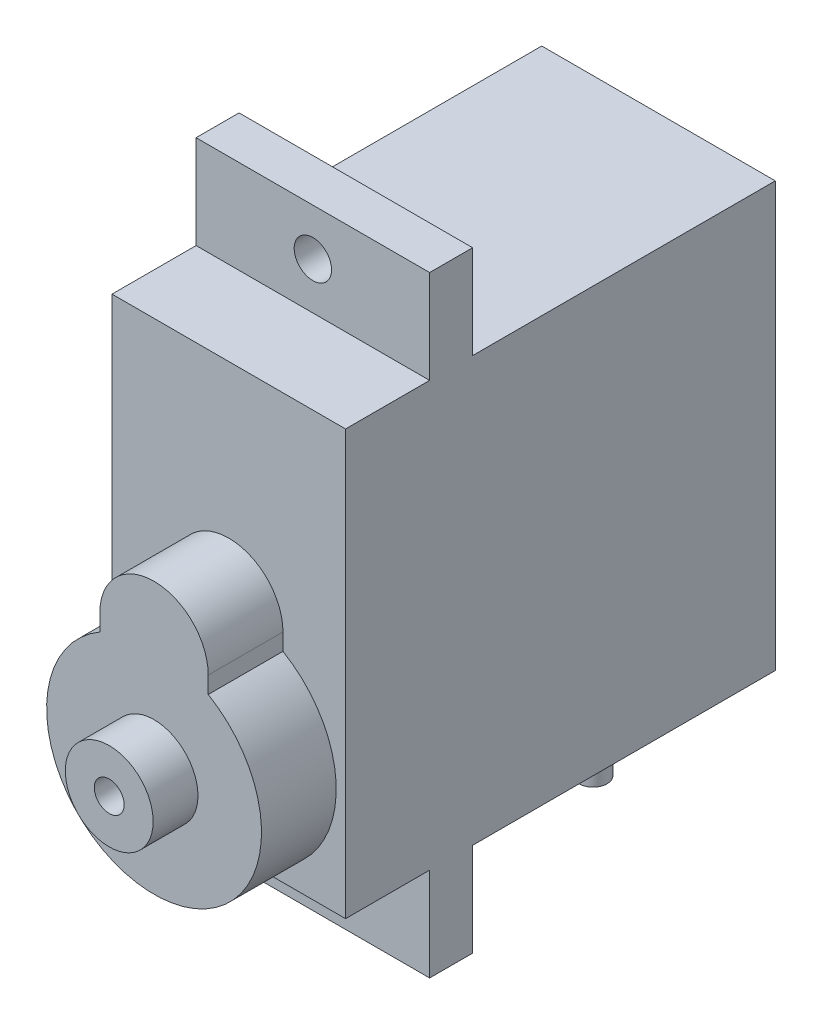
ISO-10303-21;
HEADER;
FILE_DESCRIPTION(('STEP AP214'),'2;1');
FILE_NAME('part.step','',(''),(''),'','','');
FILE_SCHEMA(('AUTOMOTIVE_DESIGN { 1 0 10303 214 1 1 1 1 }'));
ENDSEC;
DATA;
#1=APPLICATION_CONTEXT('core data for automotive mechanical design processes');
#2=APPLICATION_PROTOCOL_DEFINITION('international standard','automotive_design',2000,#1);
#3=PRODUCT_CONTEXT('',#1,'mechanical');
#4=PRODUCT('Part','Part','',(#3));
#5=PRODUCT_RELATED_PRODUCT_CATEGORY('part','',(#4));
#6=PRODUCT_DEFINITION_FORMATION('','',#4);
#7=PRODUCT_DEFINITION_CONTEXT('part definition',#1,'design');
#8=PRODUCT_DEFINITION('design','',#6,#7);
#9=PRODUCT_DEFINITION_SHAPE('','',#8);
#10=(LENGTH_UNIT() NAMED_UNIT(*) SI_UNIT(.MILLI.,.METRE.));
#11=(NAMED_UNIT(*) PLANE_ANGLE_UNIT() SI_UNIT($,.RADIAN.));
#12=(NAMED_UNIT(*) SI_UNIT($,.STERADIAN.) SOLID_ANGLE_UNIT());
#13=UNCERTAINTY_MEASURE_WITH_UNIT(LENGTH_MEASURE(1.E-05),#10,'distance_accuracy_value','');
#14=(GEOMETRIC_REPRESENTATION_CONTEXT(3) GLOBAL_UNCERTAINTY_ASSIGNED_CONTEXT((#13)) GLOBAL_UNIT_ASSIGNED_CONTEXT((#10,
#11,#12)) REPRESENTATION_CONTEXT('',''));
#15=CARTESIAN_POINT('',(0.,0.,0.));
#16=DIRECTION('',(0.,0.,1.));
#17=DIRECTION('',(1.,0.,0.));
#18=AXIS2_PLACEMENT_3D('',#15,#16,#17);
#19=CARTESIAN_POINT('',(-6.25000000000001,-11.35,23.));
#20=DIRECTION('',(0.,1.,0.));
#21=DIRECTION('',(0.,0.,1.));
#22=AXIS2_PLACEMENT_3D('',#19,#20,#21);
#23=PLANE('',#22);
#24=DIRECTION('',(-1.,0.,0.));
#25=VECTOR('',#24,1.);
#26=CARTESIAN_POINT('',(6.25,-11.35,16.2));
#27=LINE('',#26,#25);
#28=CARTESIAN_POINT('',(6.24999999999999,-11.35,16.2));
#29=VERTEX_POINT('',#28);
#30=CARTESIAN_POINT('',(-6.25,-11.35,16.2));
#31=VERTEX_POINT('',#30);
#32=EDGE_CURVE('E241',#29,#31,#27,.T.);
#33=ORIENTED_EDGE('',*,*,#32,.T.);
#34=DIRECTION('',(0.,0.,-1.));
#35=VECTOR('',#34,1.);
#36=CARTESIAN_POINT('',(-6.25000000000001,-11.35,23.));
#37=LINE('',#36,#35);
#38=CARTESIAN_POINT('',(-6.25000000000001,-11.35,0.));
#39=VERTEX_POINT('',#38);
#40=EDGE_CURVE('E307',#31,#39,#37,.T.);
#41=ORIENTED_EDGE('',*,*,#40,.T.);
#42=DIRECTION('',(1.,0.,0.));
#43=VECTOR('',#42,1.);
#44=CARTESIAN_POINT('',(-6.25000000000001,-11.35,0.));
#45=LINE('',#44,#43);
#46=CARTESIAN_POINT('',(6.24999999999999,-11.35,0.));
#47=VERTEX_POINT('',#46);
#48=EDGE_CURVE('E391',#39,#47,#45,.T.);
#49=ORIENTED_EDGE('',*,*,#48,.T.);
#50=DIRECTION('',(0.,0.,-1.));
#51=VECTOR('',#50,1.);
#52=CARTESIAN_POINT('',(6.24999999999999,-11.35,23.));
#53=LINE('',#52,#51);
#54=EDGE_CURVE('E57',#29,#47,#53,.T.);
#55=ORIENTED_EDGE('',*,*,#54,.F.);
#56=EDGE_LOOP('',(#33,#41,#49,#55));
#57=FACE_BOUND('',#56,.T.);
#58=CARTESIAN_POINT('',(1.25,-11.35,4.75));
#59=DIRECTION('',(0.,1.,0.));
#60=DIRECTION('',(0.,0.,1.));
#61=AXIS2_PLACEMENT_3D('',#58,#59,#60);
#62=CIRCLE('',#61,0.75);
#63=CARTESIAN_POINT('',(0.625,-11.35,4.33542190120558));
#64=VERTEX_POINT('',#63);
#65=CARTESIAN_POINT('',(0.625000000000001,-11.35,5.16457809879443));
#66=VERTEX_POINT('',#65);
#67=EDGE_CURVE('E187',#64,#66,#62,.F.);
#68=ORIENTED_EDGE('',*,*,#67,.F.);
#69=CARTESIAN_POINT('',(0.,-11.35,4.75));
#70=DIRECTION('',(0.,1.,0.));
#71=DIRECTION('',(0.,0.,1.));
#72=AXIS2_PLACEMENT_3D('',#69,#70,#71);
#73=CIRCLE('',#72,0.75);
#74=CARTESIAN_POINT('',(-0.625,-11.35,4.33542190120558));
#75=VERTEX_POINT('',#74);
#76=EDGE_CURVE('E199',#75,#64,#73,.F.);
#77=ORIENTED_EDGE('',*,*,#76,.F.);
#78=CARTESIAN_POINT('',(-1.25,-11.35,4.75));
#79=DIRECTION('',(0.,1.,0.));
#80=DIRECTION('',(0.,0.,1.));
#81=AXIS2_PLACEMENT_3D('',#78,#79,#80);
#82=CIRCLE('',#81,0.75);
#83=CARTESIAN_POINT('',(-0.625,-11.35,5.16457809879442));
#84=VERTEX_POINT('',#83);
#85=EDGE_CURVE('E186',#84,#75,#82,.F.);
#86=ORIENTED_EDGE('',*,*,#85,.F.);
#87=CARTESIAN_POINT('',(0.,-11.35,4.75));
#88=DIRECTION('',(0.,1.,0.));
#89=DIRECTION('',(0.,0.,1.));
#90=AXIS2_PLACEMENT_3D('',#87,#88,#89);
#91=CIRCLE('',#90,0.75);
#92=EDGE_CURVE('E176',#66,#84,#91,.F.);
#93=ORIENTED_EDGE('',*,*,#92,.F.);
#94=EDGE_LOOP('',(#68,#77,#86,#93));
#95=FACE_BOUND('',#94,.T.);
#96=ADVANCED_FACE('F34',(#57,#95),#23,.F.);
#97=DIRECTION('',(-1.,0.,0.));
#98=VECTOR('',#97,1.);
#99=CARTESIAN_POINT('',(6.25,-11.35,18.5));
#100=LINE('',#99,#98);
#101=CARTESIAN_POINT('',(6.24999999999999,-11.35,18.5));
#102=VERTEX_POINT('',#101);
#103=CARTESIAN_POINT('',(-6.25000000000001,-11.35,18.5));
#104=VERTEX_POINT('',#103);
#105=EDGE_CURVE('E254',#102,#104,#100,.T.);
#106=ORIENTED_EDGE('',*,*,#105,.F.);
#107=CARTESIAN_POINT('',(6.24999999999999,-11.35,23.));
#108=VERTEX_POINT('',#107);
#109=EDGE_CURVE('E392',#108,#102,#53,.T.);
#110=ORIENTED_EDGE('',*,*,#109,.F.);
#111=DIRECTION('',(1.,0.,0.));
#112=VECTOR('',#111,1.);
#113=CARTESIAN_POINT('',(-6.25000000000001,-11.35,23.));
#114=LINE('',#113,#112);
#115=CARTESIAN_POINT('',(0.,-11.35,23.));
#116=VERTEX_POINT('',#115);
#117=EDGE_CURVE('E377',#116,#108,#114,.T.);
#118=ORIENTED_EDGE('',*,*,#117,.F.);
#119=CARTESIAN_POINT('',(-6.25000000000001,-11.35,23.));
#120=VERTEX_POINT('',#119);
#121=EDGE_CURVE('E379',#120,#116,#114,.T.);
#122=ORIENTED_EDGE('',*,*,#121,.F.);
#123=EDGE_CURVE('E49',#120,#104,#37,.T.);
#124=ORIENTED_EDGE('',*,*,#123,.T.);
#125=EDGE_LOOP('',(#106,#110,#118,#122,#124));
#126=FACE_BOUND('',#125,.T.);
#127=ADVANCED_FACE('F413',(#126),#23,.F.);
#128=CARTESIAN_POINT('',(-6.25000000000001,11.35,23.));
#129=DIRECTION('',(0.,-1.,0.));
#130=DIRECTION('',(0.,0.,-1.));
#131=AXIS2_PLACEMENT_3D('',#128,#129,#130);
#132=PLANE('',#131);
#133=DIRECTION('',(-1.,0.,0.));
#134=VECTOR('',#133,1.);
#135=CARTESIAN_POINT('',(6.25,11.35,16.2));
#136=LINE('',#135,#134);
#137=CARTESIAN_POINT('',(6.25,11.35,16.2));
#138=VERTEX_POINT('',#137);
#139=CARTESIAN_POINT('',(-6.25,11.35,16.2));
#140=VERTEX_POINT('',#139);
#141=EDGE_CURVE('E270',#138,#140,#136,.T.);
#142=ORIENTED_EDGE('',*,*,#141,.F.);
#143=DIRECTION('',(0.,0.,-1.));
#144=VECTOR('',#143,1.);
#145=CARTESIAN_POINT('',(6.24999999999999,11.35,23.));
#146=LINE('',#145,#144);
#147=CARTESIAN_POINT('',(6.24999999999999,11.35,0.));
#148=VERTEX_POINT('',#147);
#149=EDGE_CURVE('E305',#138,#148,#146,.T.);
#150=ORIENTED_EDGE('',*,*,#149,.T.);
#151=DIRECTION('',(-1.,0.,0.));
#152=VECTOR('',#151,1.);
#153=CARTESIAN_POINT('',(-6.25000000000001,11.35,0.));
#154=LINE('',#153,#152);
#155=CARTESIAN_POINT('',(-6.25000000000001,11.35,0.));
#156=VERTEX_POINT('',#155);
#157=EDGE_CURVE('E300',#148,#156,#154,.T.);
#158=ORIENTED_EDGE('',*,*,#157,.T.);
#159=DIRECTION('',(0.,0.,-1.));
#160=VECTOR('',#159,1.);
#161=CARTESIAN_POINT('',(-6.25000000000001,11.35,23.));
#162=LINE('',#161,#160);
#163=EDGE_CURVE('E293',#140,#156,#162,.T.);
#164=ORIENTED_EDGE('',*,*,#163,.F.);
#165=EDGE_LOOP('',(#142,#150,#158,#164));
#166=FACE_BOUND('',#165,.T.);
#167=ADVANCED_FACE('F297',(#166),#132,.F.);
#168=CARTESIAN_POINT('',(0.,0.,23.));
#169=DIRECTION('',(0.,0.,-1.));
#170=DIRECTION('',(-1.,0.,0.));
#171=AXIS2_PLACEMENT_3D('',#168,#169,#170);
#172=PLANE('',#171);
#173=DIRECTION('',(0.,1.,0.));
#174=VECTOR('',#173,1.);
#175=CARTESIAN_POINT('',(2.9,0.26512839713135,23.));
#176=LINE('',#175,#174);
#177=CARTESIAN_POINT('',(2.9,-0.634871602868653,23.));
#178=VERTEX_POINT('',#177);
#179=CARTESIAN_POINT('',(2.9,0.26512839713135,23.));
#180=VERTEX_POINT('',#179);
#181=EDGE_CURVE('E350',#178,#180,#176,.T.);
#182=ORIENTED_EDGE('',*,*,#181,.F.);
#183=CARTESIAN_POINT('',(0.,-5.59999999999999,23.));
#184=DIRECTION('',(0.,0.,1.));
#185=DIRECTION('',(1.,0.,0.));
#186=AXIS2_PLACEMENT_3D('',#183,#184,#185);
#187=CIRCLE('',#186,5.75);
#188=EDGE_CURVE('E42',#116,#178,#187,.T.);
#189=ORIENTED_EDGE('',*,*,#188,.F.);
#190=ORIENTED_EDGE('',*,*,#117,.T.);
#191=DIRECTION('',(0.,1.,0.));
#192=VECTOR('',#191,1.);
#193=CARTESIAN_POINT('',(6.24999999999999,-11.35,23.));
#194=LINE('',#193,#192);
#195=CARTESIAN_POINT('',(6.24999999999999,11.35,23.));
#196=VERTEX_POINT('',#195);
#197=EDGE_CURVE('E381',#108,#196,#194,.T.);
#198=ORIENTED_EDGE('',*,*,#197,.T.);
#199=DIRECTION('',(-1.,0.,0.));
#200=VECTOR('',#199,1.);
#201=CARTESIAN_POINT('',(-6.25000000000001,11.35,23.));
#202=LINE('',#201,#200);
#203=CARTESIAN_POINT('',(-6.25000000000001,11.35,23.));
#204=VERTEX_POINT('',#203);
#205=EDGE_CURVE('E339',#196,#204,#202,.T.);
#206=ORIENTED_EDGE('',*,*,#205,.T.);
#207=DIRECTION('',(0.,-1.,0.));
#208=VECTOR('',#207,1.);
#209=CARTESIAN_POINT('',(-6.25000000000001,-11.35,23.));
#210=LINE('',#209,#208);
#211=EDGE_CURVE('E374',#204,#120,#210,.T.);
#212=ORIENTED_EDGE('',*,*,#211,.T.);
#213=ORIENTED_EDGE('',*,*,#121,.T.);
#214=CARTESIAN_POINT('',(-2.9,-0.634871602868654,23.));
#215=VERTEX_POINT('',#214);
#216=EDGE_CURVE('E343',#215,#116,#187,.T.);
#217=ORIENTED_EDGE('',*,*,#216,.F.);
#218=DIRECTION('',(0.,-1.,0.));
#219=VECTOR('',#218,1.);
#220=CARTESIAN_POINT('',(-2.9,0.26512839713135,23.));
#221=LINE('',#220,#219);
#222=CARTESIAN_POINT('',(-2.9,0.26512839713135,23.));
#223=VERTEX_POINT('',#222);
#224=EDGE_CURVE('E351',#223,#215,#221,.T.);
#225=ORIENTED_EDGE('',*,*,#224,.F.);
#226=CARTESIAN_POINT('',(0.,0.26512839713135,23.));
#227=DIRECTION('',(0.,0.,1.));
#228=DIRECTION('',(1.,0.,0.));
#229=AXIS2_PLACEMENT_3D('',#226,#227,#228);
#230=CIRCLE('',#229,2.9);
#231=EDGE_CURVE('E356',#180,#223,#230,.T.);
#232=ORIENTED_EDGE('',*,*,#231,.F.);
#233=EDGE_LOOP('',(#182,#189,#190,#198,#206,#212,#213,#217,#225,#232));
#234=FACE_BOUND('',#233,.T.);
#235=ADVANCED_FACE('F430',(#234),#172,.F.);
#236=CARTESIAN_POINT('',(6.24999999999999,-11.35,23.));
#237=DIRECTION('',(-1.,0.,0.));
#238=DIRECTION('',(0.,0.,1.));
#239=AXIS2_PLACEMENT_3D('',#236,#237,#238);
#240=PLANE('',#239);
#241=DIRECTION('',(0.,1.,0.));
#242=VECTOR('',#241,1.);
#243=CARTESIAN_POINT('',(6.24999999999999,-11.35,0.));
#244=LINE('',#243,#242);
#245=EDGE_CURVE('E385',#47,#148,#244,.T.);
#246=ORIENTED_EDGE('',*,*,#245,.T.);
#247=ORIENTED_EDGE('',*,*,#149,.F.);
#248=DIRECTION('',(0.,1.,0.));
#249=VECTOR('',#248,1.);
#250=CARTESIAN_POINT('',(6.25,11.35,16.2));
#251=LINE('',#250,#249);
#252=CARTESIAN_POINT('',(6.25,16.35,16.2));
#253=VERTEX_POINT('',#252);
#254=EDGE_CURVE('E261',#138,#253,#251,.T.);
#255=ORIENTED_EDGE('',*,*,#254,.T.);
#256=DIRECTION('',(0.,0.,1.));
#257=VECTOR('',#256,1.);
#258=CARTESIAN_POINT('',(6.25,16.35,16.2));
#259=LINE('',#258,#257);
#260=CARTESIAN_POINT('',(6.25,16.35,18.5));
#261=VERTEX_POINT('',#260);
#262=EDGE_CURVE('E258',#253,#261,#259,.T.);
#263=ORIENTED_EDGE('',*,*,#262,.T.);
#264=DIRECTION('',(0.,-1.,0.));
#265=VECTOR('',#264,1.);
#266=CARTESIAN_POINT('',(6.25,11.35,18.5));
#267=LINE('',#266,#265);
#268=CARTESIAN_POINT('',(6.25,11.35,18.5));
#269=VERTEX_POINT('',#268);
#270=EDGE_CURVE('E260',#261,#269,#267,.T.);
#271=ORIENTED_EDGE('',*,*,#270,.T.);
#272=EDGE_CURVE('E312',#196,#269,#146,.T.);
#273=ORIENTED_EDGE('',*,*,#272,.F.);
#274=ORIENTED_EDGE('',*,*,#197,.F.);
#275=ORIENTED_EDGE('',*,*,#109,.T.);
#276=DIRECTION('',(0.,-1.,0.));
#277=VECTOR('',#276,1.);
#278=CARTESIAN_POINT('',(6.25,-11.35,18.5));
#279=LINE('',#278,#277);
#280=CARTESIAN_POINT('',(6.25,-16.35,18.5));
#281=VERTEX_POINT('',#280);
#282=EDGE_CURVE('E234',#102,#281,#279,.T.);
#283=ORIENTED_EDGE('',*,*,#282,.T.);
#284=DIRECTION('',(0.,0.,-1.));
#285=VECTOR('',#284,1.);
#286=CARTESIAN_POINT('',(6.25,-16.35,16.2));
#287=LINE('',#286,#285);
#288=CARTESIAN_POINT('',(6.25,-16.35,16.2));
#289=VERTEX_POINT('',#288);
#290=EDGE_CURVE('E236',#281,#289,#287,.T.);
#291=ORIENTED_EDGE('',*,*,#290,.T.);
#292=DIRECTION('',(0.,1.,0.));
#293=VECTOR('',#292,1.);
#294=CARTESIAN_POINT('',(6.25,-11.35,16.2));
#295=LINE('',#294,#293);
#296=EDGE_CURVE('E239',#289,#29,#295,.T.);
#297=ORIENTED_EDGE('',*,*,#296,.T.);
#298=ORIENTED_EDGE('',*,*,#54,.T.);
#299=EDGE_LOOP('',(#246,#247,#255,#263,#271,#273,#274,#275,#283,#291,#297,#298));
#300=FACE_BOUND('',#299,.T.);
#301=ADVANCED_FACE('F36',(#300),#240,.F.);
#302=ORIENTED_EDGE('',*,*,#272,.T.);
#303=DIRECTION('',(-1.,0.,0.));
#304=VECTOR('',#303,1.);
#305=CARTESIAN_POINT('',(6.25,11.35,18.5));
#306=LINE('',#305,#304);
#307=CARTESIAN_POINT('',(-6.25000000000001,11.35,18.5));
#308=VERTEX_POINT('',#307);
#309=EDGE_CURVE('E273',#269,#308,#306,.T.);
#310=ORIENTED_EDGE('',*,*,#309,.T.);
#311=EDGE_CURVE('E302',#204,#308,#162,.T.);
#312=ORIENTED_EDGE('',*,*,#311,.F.);
#313=ORIENTED_EDGE('',*,*,#205,.F.);
#314=EDGE_LOOP('',(#302,#310,#312,#313));
#315=FACE_BOUND('',#314,.T.);
#316=ADVANCED_FACE('F338',(#315),#132,.F.);
#317=CARTESIAN_POINT('',(-6.25000000000001,-11.35,23.));
#318=DIRECTION('',(1.,0.,0.));
#319=DIRECTION('',(0.,0.,-1.));
#320=AXIS2_PLACEMENT_3D('',#317,#318,#319);
#321=PLANE('',#320);
#322=DIRECTION('',(0.,-1.,0.));
#323=VECTOR('',#322,1.);
#324=CARTESIAN_POINT('',(-6.25000000000001,-11.35,0.));
#325=LINE('',#324,#323);
#326=EDGE_CURVE('E389',#156,#39,#325,.T.);
#327=ORIENTED_EDGE('',*,*,#326,.T.);
#328=ORIENTED_EDGE('',*,*,#40,.F.);
#329=DIRECTION('',(0.,1.,0.));
#330=VECTOR('',#329,1.);
#331=CARTESIAN_POINT('',(-6.25,-11.35,16.2));
#332=LINE('',#331,#330);
#333=CARTESIAN_POINT('',(-6.25,-16.35,16.2));
#334=VERTEX_POINT('',#333);
#335=EDGE_CURVE('E237',#334,#31,#332,.T.);
#336=ORIENTED_EDGE('',*,*,#335,.F.);
#337=DIRECTION('',(0.,0.,-1.));
#338=VECTOR('',#337,1.);
#339=CARTESIAN_POINT('',(-6.25,-16.35,16.2));
#340=LINE('',#339,#338);
#341=CARTESIAN_POINT('',(-6.25,-16.35,18.5));
#342=VERTEX_POINT('',#341);
#343=EDGE_CURVE('E243',#342,#334,#340,.T.);
#344=ORIENTED_EDGE('',*,*,#343,.F.);
#345=DIRECTION('',(0.,-1.,0.));
#346=VECTOR('',#345,1.);
#347=CARTESIAN_POINT('',(-6.25,-11.35,18.5));
#348=LINE('',#347,#346);
#349=EDGE_CURVE('E233',#104,#342,#348,.T.);
#350=ORIENTED_EDGE('',*,*,#349,.F.);
#351=ORIENTED_EDGE('',*,*,#123,.F.);
#352=ORIENTED_EDGE('',*,*,#211,.F.);
#353=ORIENTED_EDGE('',*,*,#311,.T.);
#354=DIRECTION('',(0.,-1.,0.));
#355=VECTOR('',#354,1.);
#356=CARTESIAN_POINT('',(-6.25,11.35,18.5));
#357=LINE('',#356,#355);
#358=CARTESIAN_POINT('',(-6.25,16.35,18.5));
#359=VERTEX_POINT('',#358);
#360=EDGE_CURVE('E264',#359,#308,#357,.T.);
#361=ORIENTED_EDGE('',*,*,#360,.F.);
#362=DIRECTION('',(0.,0.,1.));
#363=VECTOR('',#362,1.);
#364=CARTESIAN_POINT('',(-6.25,16.35,16.2));
#365=LINE('',#364,#363);
#366=CARTESIAN_POINT('',(-6.25,16.35,16.2));
#367=VERTEX_POINT('',#366);
#368=EDGE_CURVE('E262',#367,#359,#365,.T.);
#369=ORIENTED_EDGE('',*,*,#368,.F.);
#370=DIRECTION('',(0.,1.,0.));
#371=VECTOR('',#370,1.);
#372=CARTESIAN_POINT('',(-6.25,11.35,16.2));
#373=LINE('',#372,#371);
#374=EDGE_CURVE('E257',#140,#367,#373,.T.);
#375=ORIENTED_EDGE('',*,*,#374,.F.);
#376=ORIENTED_EDGE('',*,*,#163,.T.);
#377=EDGE_LOOP('',(#327,#328,#336,#344,#350,#351,#352,#353,#361,#369,#375,#376));
#378=FACE_BOUND('',#377,.T.);
#379=ADVANCED_FACE('F292',(#378),#321,.F.);
#380=CARTESIAN_POINT('',(0.,0.,0.));
#381=DIRECTION('',(0.,0.,-1.));
#382=DIRECTION('',(-1.,0.,0.));
#383=AXIS2_PLACEMENT_3D('',#380,#381,#382);
#384=PLANE('',#383);
#385=ORIENTED_EDGE('',*,*,#245,.F.);
#386=ORIENTED_EDGE('',*,*,#48,.F.);
#387=ORIENTED_EDGE('',*,*,#326,.F.);
#388=ORIENTED_EDGE('',*,*,#157,.F.);
#389=EDGE_LOOP('',(#385,#386,#387,#388));
#390=FACE_BOUND('',#389,.T.);
#391=ADVANCED_FACE('F401',(#390),#384,.T.);
#392=CARTESIAN_POINT('',(0.,0.26512839713135,27.));
#393=DIRECTION('',(0.,0.,-1.));
#394=DIRECTION('',(-1.,0.,0.));
#395=AXIS2_PLACEMENT_3D('',#392,#393,#394);
#396=CYLINDRICAL_SURFACE('',#395,2.9);
#397=ORIENTED_EDGE('',*,*,#231,.T.);
#398=DIRECTION('',(0.,0.,-1.));
#399=VECTOR('',#398,1.);
#400=CARTESIAN_POINT('',(-2.9,0.26512839713135,27.));
#401=LINE('',#400,#399);
#402=CARTESIAN_POINT('',(-2.9,0.26512839713135,27.));
#403=VERTEX_POINT('',#402);
#404=EDGE_CURVE('E387',#403,#223,#401,.T.);
#405=ORIENTED_EDGE('',*,*,#404,.F.);
#406=CARTESIAN_POINT('',(0.,0.26512839713135,27.));
#407=DIRECTION('',(0.,0.,1.));
#408=DIRECTION('',(1.,0.,0.));
#409=AXIS2_PLACEMENT_3D('',#406,#407,#408);
#410=CIRCLE('',#409,2.9);
#411=CARTESIAN_POINT('',(2.9,0.26512839713135,27.));
#412=VERTEX_POINT('',#411);
#413=EDGE_CURVE('E354',#412,#403,#410,.T.);
#414=ORIENTED_EDGE('',*,*,#413,.F.);
#415=DIRECTION('',(0.,0.,-1.));
#416=VECTOR('',#415,1.);
#417=CARTESIAN_POINT('',(2.9,0.26512839713135,27.));
#418=LINE('',#417,#416);
#419=EDGE_CURVE('E365',#412,#180,#418,.T.);
#420=ORIENTED_EDGE('',*,*,#419,.T.);
#421=EDGE_LOOP('',(#397,#405,#414,#420));
#422=FACE_BOUND('',#421,.T.);
#423=ADVANCED_FACE('F425',(#422),#396,.T.);
#424=CARTESIAN_POINT('',(-2.9,0.26512839713135,27.));
#425=DIRECTION('',(1.,0.,0.));
#426=DIRECTION('',(0.,0.,-1.));
#427=AXIS2_PLACEMENT_3D('',#424,#425,#426);
#428=PLANE('',#427);
#429=ORIENTED_EDGE('',*,*,#224,.T.);
#430=DIRECTION('',(0.,0.,-1.));
#431=VECTOR('',#430,1.);
#432=CARTESIAN_POINT('',(-2.9,-0.634871602868654,27.));
#433=LINE('',#432,#431);
#434=CARTESIAN_POINT('',(-2.9,-0.634871602868654,27.));
#435=VERTEX_POINT('',#434);
#436=EDGE_CURVE('E417',#435,#215,#433,.T.);
#437=ORIENTED_EDGE('',*,*,#436,.F.);
#438=DIRECTION('',(0.,-1.,0.));
#439=VECTOR('',#438,1.);
#440=CARTESIAN_POINT('',(-2.9,0.26512839713135,27.));
#441=LINE('',#440,#439);
#442=EDGE_CURVE('E368',#403,#435,#441,.T.);
#443=ORIENTED_EDGE('',*,*,#442,.F.);
#444=ORIENTED_EDGE('',*,*,#404,.T.);
#445=EDGE_LOOP('',(#429,#437,#443,#444));
#446=FACE_BOUND('',#445,.T.);
#447=ADVANCED_FACE('F431',(#446),#428,.F.);
#448=CARTESIAN_POINT('',(0.,-5.59999999999999,27.));
#449=DIRECTION('',(0.,0.,-1.));
#450=DIRECTION('',(-1.,0.,0.));
#451=AXIS2_PLACEMENT_3D('',#448,#449,#450);
#452=CYLINDRICAL_SURFACE('',#451,5.75);
#453=ORIENTED_EDGE('',*,*,#216,.T.);
#454=ORIENTED_EDGE('',*,*,#188,.T.);
#455=DIRECTION('',(0.,0.,-1.));
#456=VECTOR('',#455,1.);
#457=CARTESIAN_POINT('',(2.9,-0.634871602868653,27.));
#458=LINE('',#457,#456);
#459=CARTESIAN_POINT('',(2.9,-0.634871602868653,27.));
#460=VERTEX_POINT('',#459);
#461=EDGE_CURVE('E419',#460,#178,#458,.T.);
#462=ORIENTED_EDGE('',*,*,#461,.F.);
#463=CARTESIAN_POINT('',(0.,-5.59999999999999,27.));
#464=DIRECTION('',(0.,0.,1.));
#465=DIRECTION('',(1.,0.,0.));
#466=AXIS2_PLACEMENT_3D('',#463,#464,#465);
#467=CIRCLE('',#466,5.75);
#468=EDGE_CURVE('E366',#435,#460,#467,.T.);
#469=ORIENTED_EDGE('',*,*,#468,.F.);
#470=ORIENTED_EDGE('',*,*,#436,.T.);
#471=EDGE_LOOP('',(#453,#454,#462,#469,#470));
#472=FACE_BOUND('',#471,.T.);
#473=ADVANCED_FACE('F435',(#472),#452,.T.);
#474=CARTESIAN_POINT('',(2.9,0.26512839713135,27.));
#475=DIRECTION('',(-1.,0.,0.));
#476=DIRECTION('',(0.,0.,1.));
#477=AXIS2_PLACEMENT_3D('',#474,#475,#476);
#478=PLANE('',#477);
#479=ORIENTED_EDGE('',*,*,#181,.T.);
#480=ORIENTED_EDGE('',*,*,#419,.F.);
#481=DIRECTION('',(0.,1.,0.));
#482=VECTOR('',#481,1.);
#483=CARTESIAN_POINT('',(2.9,0.26512839713135,27.));
#484=LINE('',#483,#482);
#485=EDGE_CURVE('E363',#460,#412,#484,.T.);
#486=ORIENTED_EDGE('',*,*,#485,.F.);
#487=ORIENTED_EDGE('',*,*,#461,.T.);
#488=EDGE_LOOP('',(#479,#480,#486,#487));
#489=FACE_BOUND('',#488,.T.);
#490=ADVANCED_FACE('F429',(#489),#478,.F.);
#491=CARTESIAN_POINT('',(0.,0.26512839713135,27.));
#492=DIRECTION('',(0.,0.,1.));
#493=DIRECTION('',(1.,0.,0.));
#494=AXIS2_PLACEMENT_3D('',#491,#492,#493);
#495=PLANE('',#494);
#496=CARTESIAN_POINT('',(0.,-5.59999999999999,27.));
#497=DIRECTION('',(0.,0.,1.));
#498=DIRECTION('',(1.,0.,0.));
#499=AXIS2_PLACEMENT_3D('',#496,#497,#498);
#500=CIRCLE('',#499,2.35);
#501=CARTESIAN_POINT('',(2.35,-5.59999999999999,27.));
#502=VERTEX_POINT('',#501);
#503=EDGE_CURVE('E215',#502,#502,#500,.T.);
#504=ORIENTED_EDGE('',*,*,#503,.F.);
#505=EDGE_LOOP('',(#504));
#506=FACE_BOUND('',#505,.T.);
#507=ORIENTED_EDGE('',*,*,#413,.T.);
#508=ORIENTED_EDGE('',*,*,#442,.T.);
#509=ORIENTED_EDGE('',*,*,#468,.T.);
#510=ORIENTED_EDGE('',*,*,#485,.T.);
#511=EDGE_LOOP('',(#507,#508,#509,#510));
#512=FACE_BOUND('',#511,.T.);
#513=ADVANCED_FACE('F434',(#506,#512),#495,.T.);
#514=CARTESIAN_POINT('',(6.25,11.35,16.2));
#515=DIRECTION('',(0.,0.,1.));
#516=DIRECTION('',(1.,0.,0.));
#517=AXIS2_PLACEMENT_3D('',#514,#515,#516);
#518=PLANE('',#517);
#519=CARTESIAN_POINT('',(0.,13.85,16.2));
#520=DIRECTION('',(0.,0.,1.));
#521=DIRECTION('',(1.,0.,0.));
#522=AXIS2_PLACEMENT_3D('',#519,#520,#521);
#523=CIRCLE('',#522,1.);
#524=CARTESIAN_POINT('',(0.999999999999997,13.85,16.2));
#525=VERTEX_POINT('',#524);
#526=EDGE_CURVE('E230',#525,#525,#523,.F.);
#527=ORIENTED_EDGE('',*,*,#526,.F.);
#528=EDGE_LOOP('',(#527));
#529=FACE_BOUND('',#528,.T.);
#530=ORIENTED_EDGE('',*,*,#374,.T.);
#531=DIRECTION('',(-1.,0.,0.));
#532=VECTOR('',#531,1.);
#533=CARTESIAN_POINT('',(6.25,16.35,16.2));
#534=LINE('',#533,#532);
#535=EDGE_CURVE('E287',#253,#367,#534,.T.);
#536=ORIENTED_EDGE('',*,*,#535,.F.);
#537=ORIENTED_EDGE('',*,*,#254,.F.);
#538=ORIENTED_EDGE('',*,*,#141,.T.);
#539=EDGE_LOOP('',(#530,#536,#537,#538));
#540=FACE_BOUND('',#539,.T.);
#541=ADVANCED_FACE('F285',(#529,#540),#518,.F.);
#542=CARTESIAN_POINT('',(6.25,16.35,16.2));
#543=DIRECTION('',(0.,-1.,0.));
#544=DIRECTION('',(0.,0.,-1.));
#545=AXIS2_PLACEMENT_3D('',#542,#543,#544);
#546=PLANE('',#545);
#547=ORIENTED_EDGE('',*,*,#368,.T.);
#548=DIRECTION('',(-1.,0.,0.));
#549=VECTOR('',#548,1.);
#550=CARTESIAN_POINT('',(6.25,16.35,18.5));
#551=LINE('',#550,#549);
#552=EDGE_CURVE('E322',#261,#359,#551,.T.);
#553=ORIENTED_EDGE('',*,*,#552,.F.);
#554=ORIENTED_EDGE('',*,*,#262,.F.);
#555=ORIENTED_EDGE('',*,*,#535,.T.);
#556=EDGE_LOOP('',(#547,#553,#554,#555));
#557=FACE_BOUND('',#556,.T.);
#558=ADVANCED_FACE('F484',(#557),#546,.F.);
#559=CARTESIAN_POINT('',(6.25,11.35,18.5));
#560=DIRECTION('',(0.,0.,-1.));
#561=DIRECTION('',(-1.,0.,0.));
#562=AXIS2_PLACEMENT_3D('',#559,#560,#561);
#563=PLANE('',#562);
#564=CARTESIAN_POINT('',(0.,13.85,18.5));
#565=DIRECTION('',(0.,0.,1.));
#566=DIRECTION('',(1.,0.,0.));
#567=AXIS2_PLACEMENT_3D('',#564,#565,#566);
#568=CIRCLE('',#567,1.);
#569=CARTESIAN_POINT('',(0.999999999999997,13.85,18.5));
#570=VERTEX_POINT('',#569);
#571=EDGE_CURVE('E227',#570,#570,#568,.T.);
#572=ORIENTED_EDGE('',*,*,#571,.F.);
#573=EDGE_LOOP('',(#572));
#574=FACE_BOUND('',#573,.T.);
#575=ORIENTED_EDGE('',*,*,#360,.T.);
#576=ORIENTED_EDGE('',*,*,#309,.F.);
#577=ORIENTED_EDGE('',*,*,#270,.F.);
#578=ORIENTED_EDGE('',*,*,#552,.T.);
#579=EDGE_LOOP('',(#575,#576,#577,#578));
#580=FACE_BOUND('',#579,.T.);
#581=ADVANCED_FACE('F335',(#574,#580),#563,.F.);
#582=CARTESIAN_POINT('',(6.25,-11.35,18.5));
#583=DIRECTION('',(0.,0.,-1.));
#584=DIRECTION('',(0.,1.,0.));
#585=AXIS2_PLACEMENT_3D('',#582,#583,#584);
#586=PLANE('',#585);
#587=CARTESIAN_POINT('',(0.,-13.85,18.5));
#588=DIRECTION('',(0.,0.,1.));
#589=DIRECTION('',(-1.,0.,0.));
#590=AXIS2_PLACEMENT_3D('',#587,#588,#589);
#591=CIRCLE('',#590,1.);
#592=CARTESIAN_POINT('',(-1.,-13.85,18.5));
#593=VERTEX_POINT('',#592);
#594=EDGE_CURVE('E219',#593,#593,#591,.T.);
#595=ORIENTED_EDGE('',*,*,#594,.F.);
#596=EDGE_LOOP('',(#595));
#597=FACE_BOUND('',#596,.T.);
#598=ORIENTED_EDGE('',*,*,#349,.T.);
#599=DIRECTION('',(-1.,0.,0.));
#600=VECTOR('',#599,1.);
#601=CARTESIAN_POINT('',(6.25,-16.35,18.5));
#602=LINE('',#601,#600);
#603=EDGE_CURVE('E251',#281,#342,#602,.T.);
#604=ORIENTED_EDGE('',*,*,#603,.F.);
#605=ORIENTED_EDGE('',*,*,#282,.F.);
#606=ORIENTED_EDGE('',*,*,#105,.T.);
#607=EDGE_LOOP('',(#598,#604,#605,#606));
#608=FACE_BOUND('',#607,.T.);
#609=ADVANCED_FACE('F412',(#597,#608),#586,.F.);
#610=CARTESIAN_POINT('',(6.25,-16.35,16.2));
#611=DIRECTION('',(0.,1.,0.));
#612=DIRECTION('',(0.,0.,1.));
#613=AXIS2_PLACEMENT_3D('',#610,#611,#612);
#614=PLANE('',#613);
#615=ORIENTED_EDGE('',*,*,#343,.T.);
#616=DIRECTION('',(-1.,0.,0.));
#617=VECTOR('',#616,1.);
#618=CARTESIAN_POINT('',(6.25,-16.35,16.2));
#619=LINE('',#618,#617);
#620=EDGE_CURVE('E248',#289,#334,#619,.T.);
#621=ORIENTED_EDGE('',*,*,#620,.F.);
#622=ORIENTED_EDGE('',*,*,#290,.F.);
#623=ORIENTED_EDGE('',*,*,#603,.T.);
#624=EDGE_LOOP('',(#615,#621,#622,#623));
#625=FACE_BOUND('',#624,.T.);
#626=ADVANCED_FACE('F409',(#625),#614,.F.);
#627=CARTESIAN_POINT('',(6.25,-11.35,16.2));
#628=DIRECTION('',(0.,0.,1.));
#629=DIRECTION('',(0.,-1.,0.));
#630=AXIS2_PLACEMENT_3D('',#627,#628,#629);
#631=PLANE('',#630);
#632=CARTESIAN_POINT('',(0.,-13.85,16.2));
#633=DIRECTION('',(0.,0.,1.));
#634=DIRECTION('',(0.,-1.,0.));
#635=AXIS2_PLACEMENT_3D('',#632,#633,#634);
#636=CIRCLE('',#635,1.);
#637=CARTESIAN_POINT('',(0.,-14.85,16.2));
#638=VERTEX_POINT('',#637);
#639=EDGE_CURVE('E224',#638,#638,#636,.F.);
#640=ORIENTED_EDGE('',*,*,#639,.F.);
#641=EDGE_LOOP('',(#640));
#642=FACE_BOUND('',#641,.T.);
#643=ORIENTED_EDGE('',*,*,#335,.T.);
#644=ORIENTED_EDGE('',*,*,#32,.F.);
#645=ORIENTED_EDGE('',*,*,#296,.F.);
#646=ORIENTED_EDGE('',*,*,#620,.T.);
#647=EDGE_LOOP('',(#643,#644,#645,#646));
#648=FACE_BOUND('',#647,.T.);
#649=ADVANCED_FACE('F405',(#642,#648),#631,.F.);
#650=CARTESIAN_POINT('',(0.,13.85,-0.00102500000000172));
#651=DIRECTION('',(0.,0.,1.));
#652=DIRECTION('',(1.,0.,0.));
#653=AXIS2_PLACEMENT_3D('',#650,#651,#652);
#654=CYLINDRICAL_SURFACE('',#653,1.);
#655=ORIENTED_EDGE('',*,*,#571,.T.);
#656=EDGE_LOOP('',(#655));
#657=FACE_BOUND('',#656,.T.);
#658=ORIENTED_EDGE('',*,*,#526,.T.);
#659=EDGE_LOOP('',(#658));
#660=FACE_BOUND('',#659,.T.);
#661=ADVANCED_FACE('F532',(#657,#660),#654,.F.);
#662=CARTESIAN_POINT('',(0.,-13.85,-0.00102500000000172));
#663=DIRECTION('',(0.,0.,1.));
#664=DIRECTION('',(1.,0.,0.));
#665=AXIS2_PLACEMENT_3D('',#662,#663,#664);
#666=CYLINDRICAL_SURFACE('',#665,1.);
#667=ORIENTED_EDGE('',*,*,#594,.T.);
#668=EDGE_LOOP('',(#667));
#669=FACE_BOUND('',#668,.T.);
#670=ORIENTED_EDGE('',*,*,#639,.T.);
#671=EDGE_LOOP('',(#670));
#672=FACE_BOUND('',#671,.T.);
#673=ADVANCED_FACE('F542',(#669,#672),#666,.F.);
#674=CARTESIAN_POINT('',(0.,-5.59999999999999,29.4));
#675=DIRECTION('',(0.,0.,1.));
#676=DIRECTION('',(1.,0.,0.));
#677=AXIS2_PLACEMENT_3D('',#674,#675,#676);
#678=PLANE('',#677);
#679=CARTESIAN_POINT('',(0.,-5.59999999999999,29.4));
#680=DIRECTION('',(0.,0.,1.));
#681=DIRECTION('',(1.,0.,0.));
#682=AXIS2_PLACEMENT_3D('',#679,#680,#681);
#683=CIRCLE('',#682,2.35);
#684=CARTESIAN_POINT('',(2.35,-5.59999999999999,29.4));
#685=VERTEX_POINT('',#684);
#686=EDGE_CURVE('E216',#685,#685,#683,.T.);
#687=ORIENTED_EDGE('',*,*,#686,.T.);
#688=EDGE_LOOP('',(#687));
#689=FACE_BOUND('',#688,.T.);
#690=CARTESIAN_POINT('',(0.,-5.59999999999999,29.4));
#691=DIRECTION('',(0.,0.,1.));
#692=DIRECTION('',(1.,0.,0.));
#693=AXIS2_PLACEMENT_3D('',#690,#691,#692);
#694=CIRCLE('',#693,0.8);
#695=CARTESIAN_POINT('',(0.8,-5.59999999999999,29.4));
#696=VERTEX_POINT('',#695);
#697=EDGE_CURVE('E201',#696,#696,#694,.T.);
#698=ORIENTED_EDGE('',*,*,#697,.F.);
#699=EDGE_LOOP('',(#698));
#700=FACE_BOUND('',#699,.T.);
#701=ADVANCED_FACE('F552',(#689,#700),#678,.T.);
#702=CARTESIAN_POINT('',(0.,-5.59999999999999,29.4));
#703=DIRECTION('',(0.,0.,-1.));
#704=DIRECTION('',(-1.,0.,0.));
#705=AXIS2_PLACEMENT_3D('',#702,#703,#704);
#706=CYLINDRICAL_SURFACE('',#705,2.35);
#707=ORIENTED_EDGE('',*,*,#686,.F.);
#708=EDGE_LOOP('',(#707));
#709=FACE_BOUND('',#708,.T.);
#710=ORIENTED_EDGE('',*,*,#503,.T.);
#711=EDGE_LOOP('',(#710));
#712=FACE_BOUND('',#711,.T.);
#713=ADVANCED_FACE('F575',(#709,#712),#706,.T.);
#714=CARTESIAN_POINT('',(0.,-5.59999999999999,29.4));
#715=DIRECTION('',(0.,0.,-1.));
#716=DIRECTION('',(-1.,0.,0.));
#717=AXIS2_PLACEMENT_3D('',#714,#715,#716);
#718=CYLINDRICAL_SURFACE('',#717,0.8);
#719=ORIENTED_EDGE('',*,*,#697,.T.);
#720=EDGE_LOOP('',(#719));
#721=FACE_BOUND('',#720,.T.);
#722=CARTESIAN_POINT('',(0.,-5.59999999999999,27.));
#723=DIRECTION('',(0.,0.,1.));
#724=DIRECTION('',(1.,0.,0.));
#725=AXIS2_PLACEMENT_3D('',#722,#723,#724);
#726=CIRCLE('',#725,0.8);
#727=CARTESIAN_POINT('',(0.8,-5.59999999999999,27.));
#728=VERTEX_POINT('',#727);
#729=EDGE_CURVE('E11',#728,#728,#726,.F.);
#730=ORIENTED_EDGE('',*,*,#729,.T.);
#731=EDGE_LOOP('',(#730));
#732=FACE_BOUND('',#731,.T.);
#733=ADVANCED_FACE('F588',(#721,#732),#718,.F.);
#734=ORIENTED_EDGE('',*,*,#729,.F.);
#735=EDGE_LOOP('',(#734));
#736=FACE_BOUND('',#735,.T.);
#737=ADVANCED_FACE('F565',(#736),#495,.T.);
#738=CARTESIAN_POINT('',(0.,-6.36921580214679,4.75));
#739=DIRECTION('',(0.,-1.,0.));
#740=DIRECTION('',(0.,0.,-1.));
#741=AXIS2_PLACEMENT_3D('',#738,#739,#740);
#742=CYLINDRICAL_SURFACE('',#741,0.75);
#743=DIRECTION('',(0.,-1.,0.));
#744=VECTOR('',#743,1.);
#745=CARTESIAN_POINT('',(0.625000000000001,-6.36921580214679,5.16457809879443));
#746=LINE('',#745,#744);
#747=CARTESIAN_POINT('',(0.625000000000001,-16.35,5.16457809879443));
#748=VERTEX_POINT('',#747);
#749=EDGE_CURVE('E182',#66,#748,#746,.T.);
#750=ORIENTED_EDGE('',*,*,#749,.F.);
#751=ORIENTED_EDGE('',*,*,#92,.T.);
#752=DIRECTION('',(0.,-1.,0.));
#753=VECTOR('',#752,1.);
#754=CARTESIAN_POINT('',(-0.625,-6.36921580214679,5.16457809879442));
#755=LINE('',#754,#753);
#756=CARTESIAN_POINT('',(-0.625,-16.35,5.16457809879442));
#757=VERTEX_POINT('',#756);
#758=EDGE_CURVE('E180',#84,#757,#755,.T.);
#759=ORIENTED_EDGE('',*,*,#758,.T.);
#760=CARTESIAN_POINT('',(0.,-16.35,4.75));
#761=DIRECTION('',(0.,-1.,0.));
#762=DIRECTION('',(0.,0.,-1.));
#763=AXIS2_PLACEMENT_3D('',#760,#761,#762);
#764=CIRCLE('',#763,0.75);
#765=EDGE_CURVE('E206',#748,#757,#764,.T.);
#766=ORIENTED_EDGE('',*,*,#765,.F.);
#767=EDGE_LOOP('',(#750,#751,#759,#766));
#768=FACE_BOUND('',#767,.T.);
#769=ADVANCED_FACE('F178',(#768),#742,.T.);
#770=CARTESIAN_POINT('',(1.25,-6.36921580214679,4.75));
#771=DIRECTION('',(0.,-1.,0.));
#772=DIRECTION('',(0.,0.,-1.));
#773=AXIS2_PLACEMENT_3D('',#770,#771,#772);
#774=CYLINDRICAL_SURFACE('',#773,0.75);
#775=DIRECTION('',(0.,-1.,0.));
#776=VECTOR('',#775,1.);
#777=CARTESIAN_POINT('',(0.625,-6.36921580214679,4.33542190120558));
#778=LINE('',#777,#776);
#779=CARTESIAN_POINT('',(0.625,-16.35,4.33542190120558));
#780=VERTEX_POINT('',#779);
#781=EDGE_CURVE('E207',#64,#780,#778,.T.);
#782=ORIENTED_EDGE('',*,*,#781,.F.);
#783=ORIENTED_EDGE('',*,*,#67,.T.);
#784=ORIENTED_EDGE('',*,*,#749,.T.);
#785=CARTESIAN_POINT('',(1.25,-16.35,4.75));
#786=DIRECTION('',(0.,-1.,0.));
#787=DIRECTION('',(0.,0.,-1.));
#788=AXIS2_PLACEMENT_3D('',#785,#786,#787);
#789=CIRCLE('',#788,0.75);
#790=EDGE_CURVE('E210',#780,#748,#789,.T.);
#791=ORIENTED_EDGE('',*,*,#790,.F.);
#792=EDGE_LOOP('',(#782,#783,#784,#791));
#793=FACE_BOUND('',#792,.T.);
#794=ADVANCED_FACE('F622',(#793),#774,.T.);
#795=CARTESIAN_POINT('',(0.,-6.36921580214679,4.75));
#796=DIRECTION('',(0.,-1.,0.));
#797=DIRECTION('',(0.,0.,-1.));
#798=AXIS2_PLACEMENT_3D('',#795,#796,#797);
#799=CYLINDRICAL_SURFACE('',#798,0.75);
#800=ORIENTED_EDGE('',*,*,#76,.T.);
#801=ORIENTED_EDGE('',*,*,#781,.T.);
#802=CARTESIAN_POINT('',(0.,-16.35,4.75));
#803=DIRECTION('',(0.,-1.,0.));
#804=DIRECTION('',(0.,0.,-1.));
#805=AXIS2_PLACEMENT_3D('',#802,#803,#804);
#806=CIRCLE('',#805,0.75);
#807=CARTESIAN_POINT('',(-0.625,-16.35,4.33542190120558));
#808=VERTEX_POINT('',#807);
#809=EDGE_CURVE('E195',#808,#780,#806,.T.);
#810=ORIENTED_EDGE('',*,*,#809,.F.);
#811=DIRECTION('',(0.,-1.,0.));
#812=VECTOR('',#811,1.);
#813=CARTESIAN_POINT('',(-0.625,-6.36921580214679,4.33542190120558));
#814=LINE('',#813,#812);
#815=EDGE_CURVE('E211',#75,#808,#814,.T.);
#816=ORIENTED_EDGE('',*,*,#815,.F.);
#817=EDGE_LOOP('',(#800,#801,#810,#816));
#818=FACE_BOUND('',#817,.T.);
#819=ADVANCED_FACE('F634',(#818),#799,.T.);
#820=CARTESIAN_POINT('',(-1.25,-6.36921580214679,4.75));
#821=DIRECTION('',(0.,-1.,0.));
#822=DIRECTION('',(0.,0.,-1.));
#823=AXIS2_PLACEMENT_3D('',#820,#821,#822);
#824=CYLINDRICAL_SURFACE('',#823,0.75);
#825=ORIENTED_EDGE('',*,*,#85,.T.);
#826=ORIENTED_EDGE('',*,*,#815,.T.);
#827=CARTESIAN_POINT('',(-1.25,-16.35,4.75));
#828=DIRECTION('',(0.,-1.,0.));
#829=DIRECTION('',(0.,0.,1.));
#830=AXIS2_PLACEMENT_3D('',#827,#828,#829);
#831=CIRCLE('',#830,0.75);
#832=EDGE_CURVE('E194',#757,#808,#831,.T.);
#833=ORIENTED_EDGE('',*,*,#832,.F.);
#834=ORIENTED_EDGE('',*,*,#758,.F.);
#835=EDGE_LOOP('',(#825,#826,#833,#834));
#836=FACE_BOUND('',#835,.T.);
#837=ADVANCED_FACE('F191',(#836),#824,.T.);
#838=CARTESIAN_POINT('',(2.,-16.35,5.5));
#839=DIRECTION('',(0.,-1.,0.));
#840=DIRECTION('',(0.,0.,-1.));
#841=AXIS2_PLACEMENT_3D('',#838,#839,#840);
#842=PLANE('',#841);
#843=ORIENTED_EDGE('',*,*,#790,.T.);
#844=ORIENTED_EDGE('',*,*,#765,.T.);
#845=ORIENTED_EDGE('',*,*,#832,.T.);
#846=ORIENTED_EDGE('',*,*,#809,.T.);
#847=EDGE_LOOP('',(#843,#844,#845,#846));
#848=FACE_BOUND('',#847,.T.);
#849=ADVANCED_FACE('F653',(#848),#842,.T.);
#850=CLOSED_SHELL('',(#96,#127,#167,#235,#301,#316,#379,#391,#423,#447,#473,#490,#513,#541,#558,
#581,#609,#626,#649,#661,#673,#701,#713,#733,#737,#769,#794,#819,#837,#849));
#851=MANIFOLD_SOLID_BREP('B2',#850);
#852=ADVANCED_BREP_SHAPE_REPRESENTATION('',(#18,#851),#14);
#853=SHAPE_DEFINITION_REPRESENTATION(#9,#852);
ENDSEC;
END-ISO-10303-21;
